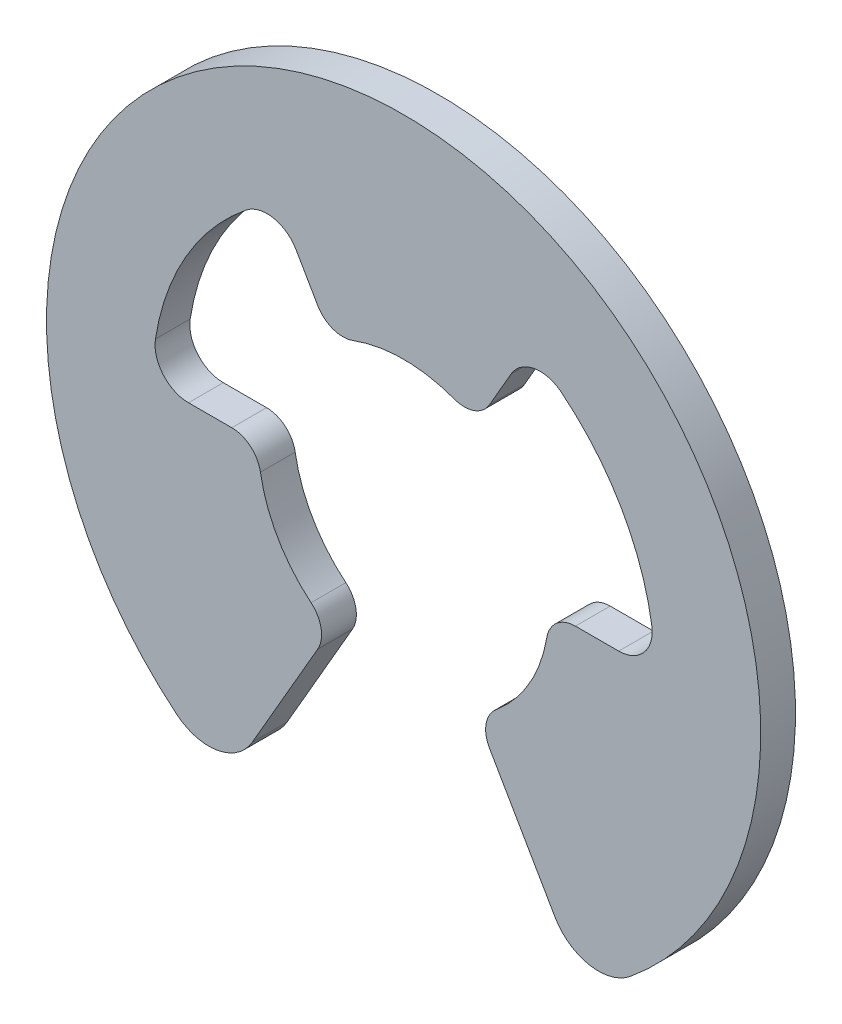
ISO-10303-21;
HEADER;
FILE_DESCRIPTION(('STEP AP214'),'2;1');
FILE_NAME('part.step','',(''),(''),'','','');
FILE_SCHEMA(('AUTOMOTIVE_DESIGN { 1 0 10303 214 1 1 1 1 }'));
ENDSEC;
DATA;
#1=APPLICATION_CONTEXT('core data for automotive mechanical design processes');
#2=APPLICATION_PROTOCOL_DEFINITION('international standard','automotive_design',2000,#1);
#3=PRODUCT_CONTEXT('',#1,'mechanical');
#4=PRODUCT('Part','Part','',(#3));
#5=PRODUCT_RELATED_PRODUCT_CATEGORY('part','',(#4));
#6=PRODUCT_DEFINITION_FORMATION('','',#4);
#7=PRODUCT_DEFINITION_CONTEXT('part definition',#1,'design');
#8=PRODUCT_DEFINITION('design','',#6,#7);
#9=PRODUCT_DEFINITION_SHAPE('','',#8);
#10=(LENGTH_UNIT() NAMED_UNIT(*) SI_UNIT(.MILLI.,.METRE.));
#11=(NAMED_UNIT(*) PLANE_ANGLE_UNIT() SI_UNIT($,.RADIAN.));
#12=(NAMED_UNIT(*) SI_UNIT($,.STERADIAN.) SOLID_ANGLE_UNIT());
#13=UNCERTAINTY_MEASURE_WITH_UNIT(LENGTH_MEASURE(1.E-05),#10,'distance_accuracy_value','');
#14=(GEOMETRIC_REPRESENTATION_CONTEXT(3) GLOBAL_UNCERTAINTY_ASSIGNED_CONTEXT((#13)) GLOBAL_UNIT_ASSIGNED_CONTEXT((#10,
#11,#12)) REPRESENTATION_CONTEXT('',''));
#15=CARTESIAN_POINT('',(0.,0.,0.));
#16=DIRECTION('',(0.,0.,1.));
#17=DIRECTION('',(1.,0.,0.));
#18=AXIS2_PLACEMENT_3D('',#15,#16,#17);
#19=CARTESIAN_POINT('',(5.19771588444957,-6.32300799517449,-0.46355));
#20=DIRECTION('',(0.,0.,1.));
#21=DIRECTION('',(1.,0.,0.));
#22=AXIS2_PLACEMENT_3D('',#19,#20,#21);
#23=PLANE('',#22);
#24=DIRECTION('',(-0.5,0.866025403784439,0.));
#25=VECTOR('',#24,1.);
#26=CARTESIAN_POINT('',(2.29159350398364,-3.96915637919445,-0.46355));
#27=LINE('',#26,#25);
#28=CARTESIAN_POINT('',(4.037371747189,-6.99293299517449,-0.46355));
#29=VERTEX_POINT('',#28);
#30=CARTESIAN_POINT('',(2.29159350398364,-3.96915637919446,-0.46355));
#31=VERTEX_POINT('',#30);
#32=EDGE_CURVE('E178',#29,#31,#27,.T.);
#33=ORIENTED_EDGE('',*,*,#32,.T.);
#34=CARTESIAN_POINT('',(2.96250338429545,-3.58180637919445,-0.46355));
#35=DIRECTION('',(0.,0.,1.));
#36=DIRECTION('',(1.,0.,0.));
#37=AXIS2_PLACEMENT_3D('',#34,#35,#36);
#38=CIRCLE('',#37,0.7747);
#39=CARTESIAN_POINT('',(2.46875282024621,-2.98483864932872,-0.46355));
#40=VERTEX_POINT('',#39);
#41=EDGE_CURVE('E277',#40,#31,#38,.T.);
#42=ORIENTED_EDGE('',*,*,#41,.F.);
#43=CARTESIAN_POINT('',(0.,0.,-0.46355));
#44=DIRECTION('',(0.,0.,1.));
#45=DIRECTION('',(1.,0.,0.));
#46=AXIS2_PLACEMENT_3D('',#43,#44,#45);
#47=CIRCLE('',#46,3.8735);
#48=CARTESIAN_POINT('',(3.81932250466809,-0.6455833449957,-0.46355));
#49=VERTEX_POINT('',#48);
#50=EDGE_CURVE('E280',#40,#49,#47,.T.);
#51=ORIENTED_EDGE('',*,*,#50,.T.);
#52=CARTESIAN_POINT('',(4.58318700796726,-0.774700000000002,-0.46355));
#53=DIRECTION('',(0.,0.,1.));
#54=DIRECTION('',(1.,0.,0.));
#55=AXIS2_PLACEMENT_3D('',#52,#53,#54);
#56=CIRCLE('',#55,0.774700000000002);
#57=CARTESIAN_POINT('',(4.58318700796726,0.,-0.46355));
#58=VERTEX_POINT('',#57);
#59=EDGE_CURVE('E201',#58,#49,#56,.T.);
#60=ORIENTED_EDGE('',*,*,#59,.F.);
#61=DIRECTION('',(1.,0.,0.));
#62=VECTOR('',#61,1.);
#63=CARTESIAN_POINT('',(5.73689495684149,0.,-0.46355));
#64=LINE('',#63,#62);
#65=CARTESIAN_POINT('',(5.73689495684149,0.,-0.46355));
#66=VERTEX_POINT('',#65);
#67=EDGE_CURVE('E198',#58,#66,#64,.T.);
#68=ORIENTED_EDGE('',*,*,#67,.T.);
#69=CARTESIAN_POINT('',(5.73689495684149,0.893233333333334,-0.46355));
#70=DIRECTION('',(0.,0.,1.));
#71=DIRECTION('',(1.,0.,0.));
#72=AXIS2_PLACEMENT_3D('',#69,#70,#71);
#73=CIRCLE('',#72,0.893233333333334);
#74=CARTESIAN_POINT('',(6.61949418097096,1.03065384615385,-0.46355));
#75=VERTEX_POINT('',#74);
#76=EDGE_CURVE('E286',#66,#75,#73,.T.);
#77=ORIENTED_EDGE('',*,*,#76,.T.);
#78=CARTESIAN_POINT('',(0.,0.,-0.46355));
#79=DIRECTION('',(0.,0.,1.));
#80=DIRECTION('',(1.,0.,0.));
#81=AXIS2_PLACEMENT_3D('',#78,#79,#80);
#82=CIRCLE('',#81,6.69925);
#83=CARTESIAN_POINT('',(4.20231950376285,5.21732319784719,-0.46355));
#84=VERTEX_POINT('',#83);
#85=EDGE_CURVE('E290',#75,#84,#82,.T.);
#86=ORIENTED_EDGE('',*,*,#85,.T.);
#87=CARTESIAN_POINT('',(3.64201023659447,4.5216801048009,-0.46355));
#88=DIRECTION('',(0.,0.,1.));
#89=DIRECTION('',(1.,0.,0.));
#90=AXIS2_PLACEMENT_3D('',#87,#88,#89);
#91=CIRCLE('',#90,0.893233333333332);
#92=CARTESIAN_POINT('',(2.86844747842075,4.96829677146756,-0.46355));
#93=VERTEX_POINT('',#92);
#94=EDGE_CURVE('E294',#84,#93,#91,.T.);
#95=ORIENTED_EDGE('',*,*,#94,.T.);
#96=DIRECTION('',(-0.5,-0.866025403784439,0.));
#97=VECTOR('',#96,1.);
#98=CARTESIAN_POINT('',(2.29159350398364,3.96915637919445,-0.46355));
#99=LINE('',#98,#97);
#100=CARTESIAN_POINT('',(2.29159350398364,3.96915637919445,-0.46355));
#101=VERTEX_POINT('',#100);
#102=EDGE_CURVE('E203',#93,#101,#99,.T.);
#103=ORIENTED_EDGE('',*,*,#102,.T.);
#104=CARTESIAN_POINT('',(1.62068362367183,4.35650637919445,-0.46355));
#105=DIRECTION('',(0.,0.,1.));
#106=DIRECTION('',(1.,0.,0.));
#107=AXIS2_PLACEMENT_3D('',#104,#105,#106);
#108=CIRCLE('',#107,0.774699999999997);
#109=CARTESIAN_POINT('',(1.3505696863932,3.63042198266205,-0.46355));
#110=VERTEX_POINT('',#109);
#111=EDGE_CURVE('E297',#110,#101,#108,.T.);
#112=ORIENTED_EDGE('',*,*,#111,.F.);
#113=CARTESIAN_POINT('',(0.,0.,-0.46355));
#114=DIRECTION('',(0.,0.,1.));
#115=DIRECTION('',(1.,0.,0.));
#116=AXIS2_PLACEMENT_3D('',#113,#114,#115);
#117=CIRCLE('',#116,3.8735);
#118=CARTESIAN_POINT('',(-1.35056966565402,3.63042199037731,-0.46355));
#119=VERTEX_POINT('',#118);
#120=EDGE_CURVE('E300',#110,#119,#117,.T.);
#121=ORIENTED_EDGE('',*,*,#120,.T.);
#122=CARTESIAN_POINT('',(-1.62068362367183,4.35650637919445,-0.46355));
#123=DIRECTION('',(0.,0.,1.));
#124=DIRECTION('',(1.,0.,0.));
#125=AXIS2_PLACEMENT_3D('',#122,#123,#124);
#126=CIRCLE('',#125,0.7747);
#127=CARTESIAN_POINT('',(-2.29159350398364,3.96915637919445,-0.46355));
#128=VERTEX_POINT('',#127);
#129=EDGE_CURVE('E211',#128,#119,#126,.T.);
#130=ORIENTED_EDGE('',*,*,#129,.F.);
#131=DIRECTION('',(-0.5,0.866025403784439,0.));
#132=VECTOR('',#131,1.);
#133=CARTESIAN_POINT('',(-2.86844747842075,4.96829677146756,-0.46355));
#134=LINE('',#133,#132);
#135=CARTESIAN_POINT('',(-2.86844747842075,4.96829677146756,-0.46355));
#136=VERTEX_POINT('',#135);
#137=EDGE_CURVE('E208',#128,#136,#134,.T.);
#138=ORIENTED_EDGE('',*,*,#137,.T.);
#139=CARTESIAN_POINT('',(-3.64201023659447,4.5216801048009,-0.46355));
#140=DIRECTION('',(0.,0.,1.));
#141=DIRECTION('',(1.,0.,0.));
#142=AXIS2_PLACEMENT_3D('',#139,#140,#141);
#143=CIRCLE('',#142,0.893233333333332);
#144=CARTESIAN_POINT('',(-4.20231950376285,5.21732319784718,-0.46355));
#145=VERTEX_POINT('',#144);
#146=EDGE_CURVE('E306',#136,#145,#143,.T.);
#147=ORIENTED_EDGE('',*,*,#146,.T.);
#148=CARTESIAN_POINT('',(0.,0.,-0.46355));
#149=DIRECTION('',(0.,0.,1.));
#150=DIRECTION('',(1.,0.,0.));
#151=AXIS2_PLACEMENT_3D('',#148,#149,#150);
#152=CIRCLE('',#151,6.69925);
#153=CARTESIAN_POINT('',(-6.61949418097095,1.03065384615384,-0.46355));
#154=VERTEX_POINT('',#153);
#155=EDGE_CURVE('E310',#145,#154,#152,.T.);
#156=ORIENTED_EDGE('',*,*,#155,.T.);
#157=CARTESIAN_POINT('',(-5.73689495684149,0.893233333333332,-0.46355));
#158=DIRECTION('',(0.,0.,1.));
#159=DIRECTION('',(1.,0.,0.));
#160=AXIS2_PLACEMENT_3D('',#157,#158,#159);
#161=CIRCLE('',#160,0.893233333333332);
#162=CARTESIAN_POINT('',(-5.73689495684149,0.,-0.46355));
#163=VERTEX_POINT('',#162);
#164=EDGE_CURVE('E314',#154,#163,#161,.T.);
#165=ORIENTED_EDGE('',*,*,#164,.T.);
#166=DIRECTION('',(1.,0.,0.));
#167=VECTOR('',#166,1.);
#168=CARTESIAN_POINT('',(-4.58318700796726,0.,-0.46355));
#169=LINE('',#168,#167);
#170=CARTESIAN_POINT('',(-4.58318700796726,0.,-0.46355));
#171=VERTEX_POINT('',#170);
#172=EDGE_CURVE('E213',#163,#171,#169,.T.);
#173=ORIENTED_EDGE('',*,*,#172,.T.);
#174=CARTESIAN_POINT('',(-4.58318700796726,-0.7747,-0.46355));
#175=DIRECTION('',(0.,0.,1.));
#176=DIRECTION('',(1.,0.,0.));
#177=AXIS2_PLACEMENT_3D('',#174,#175,#176);
#178=CIRCLE('',#177,0.7747);
#179=CARTESIAN_POINT('',(-3.81932250663939,-0.645583333333331,-0.46355));
#180=VERTEX_POINT('',#179);
#181=EDGE_CURVE('E317',#180,#171,#178,.T.);
#182=ORIENTED_EDGE('',*,*,#181,.F.);
#183=CARTESIAN_POINT('',(0.,0.,-0.46355));
#184=DIRECTION('',(0.,0.,1.));
#185=DIRECTION('',(1.,0.,0.));
#186=AXIS2_PLACEMENT_3D('',#183,#184,#185);
#187=CIRCLE('',#186,3.8735);
#188=CARTESIAN_POINT('',(-2.46875282024621,-2.98483864932872,-0.46355));
#189=VERTEX_POINT('',#188);
#190=EDGE_CURVE('E320',#180,#189,#187,.T.);
#191=ORIENTED_EDGE('',*,*,#190,.T.);
#192=CARTESIAN_POINT('',(-2.96250338429545,-3.58180637919445,-0.46355));
#193=DIRECTION('',(0.,0.,1.));
#194=DIRECTION('',(1.,0.,0.));
#195=AXIS2_PLACEMENT_3D('',#192,#193,#194);
#196=CIRCLE('',#195,0.7747);
#197=CARTESIAN_POINT('',(-2.29159350398364,-3.96915637919446,-0.46355));
#198=VERTEX_POINT('',#197);
#199=EDGE_CURVE('E221',#198,#189,#196,.T.);
#200=ORIENTED_EDGE('',*,*,#199,.F.);
#201=DIRECTION('',(-0.5,-0.866025403784439,0.));
#202=VECTOR('',#201,1.);
#203=CARTESIAN_POINT('',(-4.037371747189,-6.99293299517449,-0.46355));
#204=LINE('',#203,#202);
#205=CARTESIAN_POINT('',(-4.037371747189,-6.9929329951745,-0.46355));
#206=VERTEX_POINT('',#205);
#207=EDGE_CURVE('E218',#198,#206,#204,.T.);
#208=ORIENTED_EDGE('',*,*,#207,.T.);
#209=CARTESIAN_POINT('',(-5.1977158844496,-6.32300799517449,-0.46355));
#210=DIRECTION('',(0.,0.,1.));
#211=DIRECTION('',(1.,0.,0.));
#212=AXIS2_PLACEMENT_3D('',#209,#210,#211);
#213=CIRCLE('',#212,1.33985);
#214=CARTESIAN_POINT('',(-6.04854447375826,-7.35803878414409,-0.46355));
#215=VERTEX_POINT('',#214);
#216=EDGE_CURVE('E326',#215,#206,#213,.T.);
#217=ORIENTED_EDGE('',*,*,#216,.F.);
#218=CARTESIAN_POINT('',(0.,0.,-0.46355));
#219=DIRECTION('',(0.,0.,1.));
#220=DIRECTION('',(1.,0.,0.));
#221=AXIS2_PLACEMENT_3D('',#218,#219,#220);
#222=CIRCLE('',#221,9.525);
#223=CARTESIAN_POINT('',(6.04854443090217,-7.35803881937316,-0.46355));
#224=VERTEX_POINT('',#223);
#225=EDGE_CURVE('E180',#224,#215,#222,.T.);
#226=ORIENTED_EDGE('',*,*,#225,.F.);
#227=CARTESIAN_POINT('',(5.19771588444957,-6.32300799517449,-0.46355));
#228=DIRECTION('',(0.,0.,1.));
#229=DIRECTION('',(1.,0.,0.));
#230=AXIS2_PLACEMENT_3D('',#227,#228,#229);
#231=CIRCLE('',#230,1.33985);
#232=EDGE_CURVE('E20',#29,#224,#231,.T.);
#233=ORIENTED_EDGE('',*,*,#232,.F.);
#234=EDGE_LOOP('',(#33,#42,#51,#60,#68,#77,#86,#95,#103,#112,#121,#130,#138,#147,#156,#165,#173,
#182,#191,#200,#208,#217,#226,#233));
#235=FACE_BOUND('',#234,.T.);
#236=ADVANCED_FACE('F17',(#235),#23,.F.);
#237=CARTESIAN_POINT('',(5.19771588444957,-6.32300799517449,0.46355));
#238=DIRECTION('',(0.,0.,1.));
#239=DIRECTION('',(1.,0.,0.));
#240=AXIS2_PLACEMENT_3D('',#237,#238,#239);
#241=CYLINDRICAL_SURFACE('',#240,1.33985);
#242=CARTESIAN_POINT('',(5.19771588444957,-6.32300799517449,0.46355));
#243=DIRECTION('',(0.,0.,1.));
#244=DIRECTION('',(1.,0.,0.));
#245=AXIS2_PLACEMENT_3D('',#242,#243,#244);
#246=CIRCLE('',#245,1.33985);
#247=CARTESIAN_POINT('',(4.037371747189,-6.99293299517449,0.46355));
#248=VERTEX_POINT('',#247);
#249=CARTESIAN_POINT('',(6.04854443090217,-7.35803881937316,0.46355));
#250=VERTEX_POINT('',#249);
#251=EDGE_CURVE('E187',#248,#250,#246,.T.);
#252=ORIENTED_EDGE('',*,*,#251,.F.);
#253=DIRECTION('',(0.,0.,1.));
#254=VECTOR('',#253,1.);
#255=CARTESIAN_POINT('',(4.037371747189,-6.99293299517449,0.46355));
#256=LINE('',#255,#254);
#257=EDGE_CURVE('E184',#248,#29,#256,.F.);
#258=ORIENTED_EDGE('',*,*,#257,.T.);
#259=ORIENTED_EDGE('',*,*,#232,.T.);
#260=DIRECTION('',(0.,0.,1.));
#261=VECTOR('',#260,1.);
#262=CARTESIAN_POINT('',(6.04854438804611,-7.35803885460222,0.46355));
#263=LINE('',#262,#261);
#264=EDGE_CURVE('E196',#250,#224,#263,.F.);
#265=ORIENTED_EDGE('',*,*,#264,.F.);
#266=EDGE_LOOP('',(#252,#258,#259,#265));
#267=FACE_BOUND('',#266,.T.);
#268=ADVANCED_FACE('F185',(#267),#241,.T.);
#269=CARTESIAN_POINT('',(0.,0.,0.46355));
#270=DIRECTION('',(0.,0.,1.));
#271=DIRECTION('',(1.,0.,0.));
#272=AXIS2_PLACEMENT_3D('',#269,#270,#271);
#273=CYLINDRICAL_SURFACE('',#272,9.525);
#274=CARTESIAN_POINT('',(0.,0.,0.46355));
#275=DIRECTION('',(0.,0.,1.));
#276=DIRECTION('',(1.,0.,0.));
#277=AXIS2_PLACEMENT_3D('',#274,#275,#276);
#278=CIRCLE('',#277,9.525);
#279=CARTESIAN_POINT('',(-6.04854447375826,-7.35803878414409,0.46355));
#280=VERTEX_POINT('',#279);
#281=EDGE_CURVE('E192',#250,#280,#278,.T.);
#282=ORIENTED_EDGE('',*,*,#281,.F.);
#283=ORIENTED_EDGE('',*,*,#264,.T.);
#284=ORIENTED_EDGE('',*,*,#225,.T.);
#285=DIRECTION('',(0.,0.,1.));
#286=VECTOR('',#285,1.);
#287=CARTESIAN_POINT('',(-6.04854447375826,-7.35803878414409,0.46355));
#288=LINE('',#287,#286);
#289=EDGE_CURVE('E327',#280,#215,#288,.F.);
#290=ORIENTED_EDGE('',*,*,#289,.F.);
#291=EDGE_LOOP('',(#282,#283,#284,#290));
#292=FACE_BOUND('',#291,.T.);
#293=ADVANCED_FACE('F331',(#292),#273,.T.);
#294=CARTESIAN_POINT('',(-5.1977158844496,-6.32300799517449,0.46355));
#295=DIRECTION('',(0.,0.,1.));
#296=DIRECTION('',(1.,0.,0.));
#297=AXIS2_PLACEMENT_3D('',#294,#295,#296);
#298=CYLINDRICAL_SURFACE('',#297,1.33985);
#299=CARTESIAN_POINT('',(-5.1977158844496,-6.32300799517449,0.46355));
#300=DIRECTION('',(0.,0.,1.));
#301=DIRECTION('',(1.,0.,0.));
#302=AXIS2_PLACEMENT_3D('',#299,#300,#301);
#303=CIRCLE('',#302,1.33985);
#304=CARTESIAN_POINT('',(-4.037371747189,-6.99293299517449,0.46355));
#305=VERTEX_POINT('',#304);
#306=EDGE_CURVE('E272',#280,#305,#303,.T.);
#307=ORIENTED_EDGE('',*,*,#306,.F.);
#308=ORIENTED_EDGE('',*,*,#289,.T.);
#309=ORIENTED_EDGE('',*,*,#216,.T.);
#310=DIRECTION('',(0.,0.,1.));
#311=VECTOR('',#310,1.);
#312=CARTESIAN_POINT('',(-4.037371747189,-6.99293299517449,0.46355));
#313=LINE('',#312,#311);
#314=EDGE_CURVE('E222',#206,#305,#313,.T.);
#315=ORIENTED_EDGE('',*,*,#314,.T.);
#316=EDGE_LOOP('',(#307,#308,#309,#315));
#317=FACE_BOUND('',#316,.T.);
#318=ADVANCED_FACE('F367',(#317),#298,.T.);
#319=CARTESIAN_POINT('',(-4.037371747189,-6.99293299517449,0.46355));
#320=DIRECTION('',(-0.866025403784439,0.5,0.));
#321=DIRECTION('',(-0.5,-0.866025403784439,0.));
#322=AXIS2_PLACEMENT_3D('',#319,#320,#321);
#323=PLANE('',#322);
#324=DIRECTION('',(0.,0.,1.));
#325=VECTOR('',#324,1.);
#326=CARTESIAN_POINT('',(-2.29159350398365,-3.96915637919445,0.46355));
#327=LINE('',#326,#325);
#328=CARTESIAN_POINT('',(-2.29159350398364,-3.96915637919445,0.46355));
#329=VERTEX_POINT('',#328);
#330=EDGE_CURVE('E325',#329,#198,#327,.F.);
#331=ORIENTED_EDGE('',*,*,#330,.F.);
#332=DIRECTION('',(0.499999999999998,0.86602540378444,0.));
#333=VECTOR('',#332,1.);
#334=CARTESIAN_POINT('',(-4.037371747189,-6.99293299517449,0.46355));
#335=LINE('',#334,#333);
#336=EDGE_CURVE('E271',#305,#329,#335,.T.);
#337=ORIENTED_EDGE('',*,*,#336,.F.);
#338=ORIENTED_EDGE('',*,*,#314,.F.);
#339=ORIENTED_EDGE('',*,*,#207,.F.);
#340=EDGE_LOOP('',(#331,#337,#338,#339));
#341=FACE_BOUND('',#340,.T.);
#342=ADVANCED_FACE('F587',(#341),#323,.F.);
#343=CARTESIAN_POINT('',(-2.96250338429545,-3.58180637919445,0.46355));
#344=DIRECTION('',(0.,0.,1.));
#345=DIRECTION('',(1.,0.,0.));
#346=AXIS2_PLACEMENT_3D('',#343,#344,#345);
#347=CYLINDRICAL_SURFACE('',#346,0.7747);
#348=CARTESIAN_POINT('',(-2.96250338429545,-3.58180637919445,0.46355));
#349=DIRECTION('',(0.,0.,1.));
#350=DIRECTION('',(1.,0.,0.));
#351=AXIS2_PLACEMENT_3D('',#348,#349,#350);
#352=CIRCLE('',#351,0.7747);
#353=CARTESIAN_POINT('',(-2.46875282024621,-2.98483864932872,0.46355));
#354=VERTEX_POINT('',#353);
#355=EDGE_CURVE('E268',#329,#354,#352,.T.);
#356=ORIENTED_EDGE('',*,*,#355,.F.);
#357=ORIENTED_EDGE('',*,*,#330,.T.);
#358=ORIENTED_EDGE('',*,*,#199,.T.);
#359=DIRECTION('',(0.,0.,1.));
#360=VECTOR('',#359,1.);
#361=CARTESIAN_POINT('',(-2.4687528202462,-2.98483864932872,0.46355));
#362=LINE('',#361,#360);
#363=EDGE_CURVE('E323',#189,#354,#362,.T.);
#364=ORIENTED_EDGE('',*,*,#363,.T.);
#365=EDGE_LOOP('',(#356,#357,#358,#364));
#366=FACE_BOUND('',#365,.T.);
#367=ADVANCED_FACE('F577',(#366),#347,.T.);
#368=CARTESIAN_POINT('',(0.,0.,0.46355));
#369=DIRECTION('',(0.,0.,1.));
#370=DIRECTION('',(1.,0.,0.));
#371=AXIS2_PLACEMENT_3D('',#368,#369,#370);
#372=CYLINDRICAL_SURFACE('',#371,3.8735);
#373=DIRECTION('',(0.,0.,1.));
#374=VECTOR('',#373,1.);
#375=CARTESIAN_POINT('',(-3.81932250663939,-0.645583333333329,0.46355));
#376=LINE('',#375,#374);
#377=CARTESIAN_POINT('',(-3.81932250663939,-0.645583333333331,0.46355));
#378=VERTEX_POINT('',#377);
#379=EDGE_CURVE('E319',#378,#180,#376,.F.);
#380=ORIENTED_EDGE('',*,*,#379,.F.);
#381=CARTESIAN_POINT('',(0.,0.,0.46355));
#382=DIRECTION('',(0.,0.,1.));
#383=DIRECTION('',(1.,0.,0.));
#384=AXIS2_PLACEMENT_3D('',#381,#382,#383);
#385=CIRCLE('',#384,3.8735);
#386=EDGE_CURVE('E265',#354,#378,#385,.F.);
#387=ORIENTED_EDGE('',*,*,#386,.F.);
#388=ORIENTED_EDGE('',*,*,#363,.F.);
#389=ORIENTED_EDGE('',*,*,#190,.F.);
#390=EDGE_LOOP('',(#380,#387,#388,#389));
#391=FACE_BOUND('',#390,.T.);
#392=ADVANCED_FACE('F567',(#391),#372,.F.);
#393=CARTESIAN_POINT('',(-4.58318700796726,-0.7747,0.46355));
#394=DIRECTION('',(0.,0.,1.));
#395=DIRECTION('',(1.,0.,0.));
#396=AXIS2_PLACEMENT_3D('',#393,#394,#395);
#397=CYLINDRICAL_SURFACE('',#396,0.7747);
#398=CARTESIAN_POINT('',(-4.58318700796726,-0.7747,0.46355));
#399=DIRECTION('',(0.,0.,1.));
#400=DIRECTION('',(1.,0.,0.));
#401=AXIS2_PLACEMENT_3D('',#398,#399,#400);
#402=CIRCLE('',#401,0.7747);
#403=CARTESIAN_POINT('',(-4.58318700796726,0.,0.46355));
#404=VERTEX_POINT('',#403);
#405=EDGE_CURVE('E262',#378,#404,#402,.T.);
#406=ORIENTED_EDGE('',*,*,#405,.F.);
#407=ORIENTED_EDGE('',*,*,#379,.T.);
#408=ORIENTED_EDGE('',*,*,#181,.T.);
#409=DIRECTION('',(0.,0.,-1.));
#410=VECTOR('',#409,1.);
#411=CARTESIAN_POINT('',(-4.58318700796726,0.,0.46355));
#412=LINE('',#411,#410);
#413=EDGE_CURVE('E217',#171,#404,#412,.F.);
#414=ORIENTED_EDGE('',*,*,#413,.T.);
#415=EDGE_LOOP('',(#406,#407,#408,#414));
#416=FACE_BOUND('',#415,.T.);
#417=ADVANCED_FACE('F557',(#416),#397,.T.);
#418=CARTESIAN_POINT('',(-4.58318700796726,0.,0.46355));
#419=DIRECTION('',(0.,-1.,0.));
#420=DIRECTION('',(0.,0.,-1.));
#421=AXIS2_PLACEMENT_3D('',#418,#419,#420);
#422=PLANE('',#421);
#423=DIRECTION('',(0.,0.,1.));
#424=VECTOR('',#423,1.);
#425=CARTESIAN_POINT('',(-5.73689495684149,0.,0.46355));
#426=LINE('',#425,#424);
#427=CARTESIAN_POINT('',(-5.73689495684149,0.,0.46355));
#428=VERTEX_POINT('',#427);
#429=EDGE_CURVE('E216',#163,#428,#426,.T.);
#430=ORIENTED_EDGE('',*,*,#429,.T.);
#431=DIRECTION('',(1.,0.,0.));
#432=VECTOR('',#431,1.);
#433=CARTESIAN_POINT('',(5.19771588444957,0.,0.46355));
#434=LINE('',#433,#432);
#435=EDGE_CURVE('E261',#404,#428,#434,.F.);
#436=ORIENTED_EDGE('',*,*,#435,.F.);
#437=ORIENTED_EDGE('',*,*,#413,.F.);
#438=ORIENTED_EDGE('',*,*,#172,.F.);
#439=EDGE_LOOP('',(#430,#436,#437,#438));
#440=FACE_BOUND('',#439,.T.);
#441=ADVANCED_FACE('F547',(#440),#422,.F.);
#442=CARTESIAN_POINT('',(-5.73689495684149,0.893233333333332,0.46355));
#443=DIRECTION('',(0.,0.,1.));
#444=DIRECTION('',(1.,0.,0.));
#445=AXIS2_PLACEMENT_3D('',#442,#443,#444);
#446=CYLINDRICAL_SURFACE('',#445,0.893233333333332);
#447=DIRECTION('',(0.,0.,1.));
#448=VECTOR('',#447,1.);
#449=CARTESIAN_POINT('',(-6.61949418097094,1.03065384615384,0.46355));
#450=LINE('',#449,#448);
#451=CARTESIAN_POINT('',(-6.61949418097094,1.03065384615384,0.46355));
#452=VERTEX_POINT('',#451);
#453=EDGE_CURVE('E313',#154,#452,#450,.T.);
#454=ORIENTED_EDGE('',*,*,#453,.T.);
#455=CARTESIAN_POINT('',(-5.73689495684149,0.893233333333332,0.46355));
#456=DIRECTION('',(0.,0.,1.));
#457=DIRECTION('',(1.,0.,0.));
#458=AXIS2_PLACEMENT_3D('',#455,#456,#457);
#459=CIRCLE('',#458,0.893233333333332);
#460=EDGE_CURVE('E258',#428,#452,#459,.F.);
#461=ORIENTED_EDGE('',*,*,#460,.F.);
#462=ORIENTED_EDGE('',*,*,#429,.F.);
#463=ORIENTED_EDGE('',*,*,#164,.F.);
#464=EDGE_LOOP('',(#454,#461,#462,#463));
#465=FACE_BOUND('',#464,.T.);
#466=ADVANCED_FACE('F537',(#465),#446,.F.);
#467=CARTESIAN_POINT('',(0.,0.,0.46355));
#468=DIRECTION('',(0.,0.,1.));
#469=DIRECTION('',(1.,0.,0.));
#470=AXIS2_PLACEMENT_3D('',#467,#468,#469);
#471=CYLINDRICAL_SURFACE('',#470,6.69925);
#472=DIRECTION('',(0.,0.,1.));
#473=VECTOR('',#472,1.);
#474=CARTESIAN_POINT('',(-4.20231950376285,5.21732319784719,0.46355));
#475=LINE('',#474,#473);
#476=CARTESIAN_POINT('',(-4.20231950376285,5.21732319784719,0.46355));
#477=VERTEX_POINT('',#476);
#478=EDGE_CURVE('E309',#145,#477,#475,.T.);
#479=ORIENTED_EDGE('',*,*,#478,.T.);
#480=CARTESIAN_POINT('',(0.,0.,0.46355));
#481=DIRECTION('',(0.,0.,1.));
#482=DIRECTION('',(1.,0.,0.));
#483=AXIS2_PLACEMENT_3D('',#480,#481,#482);
#484=CIRCLE('',#483,6.69925);
#485=EDGE_CURVE('E255',#452,#477,#484,.F.);
#486=ORIENTED_EDGE('',*,*,#485,.F.);
#487=ORIENTED_EDGE('',*,*,#453,.F.);
#488=ORIENTED_EDGE('',*,*,#155,.F.);
#489=EDGE_LOOP('',(#479,#486,#487,#488));
#490=FACE_BOUND('',#489,.T.);
#491=ADVANCED_FACE('F527',(#490),#471,.F.);
#492=CARTESIAN_POINT('',(-3.64201023659447,4.5216801048009,0.46355));
#493=DIRECTION('',(0.,0.,1.));
#494=DIRECTION('',(1.,0.,0.));
#495=AXIS2_PLACEMENT_3D('',#492,#493,#494);
#496=CYLINDRICAL_SURFACE('',#495,0.893233333333332);
#497=DIRECTION('',(0.,0.,1.));
#498=VECTOR('',#497,1.);
#499=CARTESIAN_POINT('',(-2.86844747842075,4.96829677146756,0.46355));
#500=LINE('',#499,#498);
#501=CARTESIAN_POINT('',(-2.86844747842075,4.96829677146757,0.46355));
#502=VERTEX_POINT('',#501);
#503=EDGE_CURVE('E212',#136,#502,#500,.T.);
#504=ORIENTED_EDGE('',*,*,#503,.T.);
#505=CARTESIAN_POINT('',(-3.64201023659447,4.5216801048009,0.46355));
#506=DIRECTION('',(0.,0.,1.));
#507=DIRECTION('',(1.,0.,0.));
#508=AXIS2_PLACEMENT_3D('',#505,#506,#507);
#509=CIRCLE('',#508,0.893233333333332);
#510=EDGE_CURVE('E252',#477,#502,#509,.F.);
#511=ORIENTED_EDGE('',*,*,#510,.F.);
#512=ORIENTED_EDGE('',*,*,#478,.F.);
#513=ORIENTED_EDGE('',*,*,#146,.F.);
#514=EDGE_LOOP('',(#504,#511,#512,#513));
#515=FACE_BOUND('',#514,.T.);
#516=ADVANCED_FACE('F517',(#515),#496,.F.);
#517=CARTESIAN_POINT('',(-2.86844747842075,4.96829677146756,0.46355));
#518=DIRECTION('',(0.866025403784439,0.5,0.));
#519=DIRECTION('',(-0.5,0.866025403784439,0.));
#520=AXIS2_PLACEMENT_3D('',#517,#518,#519);
#521=PLANE('',#520);
#522=DIRECTION('',(0.,0.,1.));
#523=VECTOR('',#522,1.);
#524=CARTESIAN_POINT('',(-2.29159350398363,3.96915637919445,0.46355));
#525=LINE('',#524,#523);
#526=CARTESIAN_POINT('',(-2.29159350398363,3.96915637919445,0.46355));
#527=VERTEX_POINT('',#526);
#528=EDGE_CURVE('E305',#527,#128,#525,.F.);
#529=ORIENTED_EDGE('',*,*,#528,.F.);
#530=DIRECTION('',(0.500000000000005,-0.866025403784436,0.));
#531=VECTOR('',#530,1.);
#532=CARTESIAN_POINT('',(-2.86844747842075,4.96829677146756,0.46355));
#533=LINE('',#532,#531);
#534=EDGE_CURVE('E251',#502,#527,#533,.T.);
#535=ORIENTED_EDGE('',*,*,#534,.F.);
#536=ORIENTED_EDGE('',*,*,#503,.F.);
#537=ORIENTED_EDGE('',*,*,#137,.F.);
#538=EDGE_LOOP('',(#529,#535,#536,#537));
#539=FACE_BOUND('',#538,.T.);
#540=ADVANCED_FACE('F507',(#539),#521,.F.);
#541=CARTESIAN_POINT('',(-1.62068362367183,4.35650637919445,0.46355));
#542=DIRECTION('',(0.,0.,1.));
#543=DIRECTION('',(1.,0.,0.));
#544=AXIS2_PLACEMENT_3D('',#541,#542,#543);
#545=CYLINDRICAL_SURFACE('',#544,0.7747);
#546=CARTESIAN_POINT('',(-1.62068362367183,4.35650637919445,0.46355));
#547=DIRECTION('',(0.,0.,1.));
#548=DIRECTION('',(1.,0.,0.));
#549=AXIS2_PLACEMENT_3D('',#546,#547,#548);
#550=CIRCLE('',#549,0.7747);
#551=CARTESIAN_POINT('',(-1.35056966565402,3.63042199037731,0.46355));
#552=VERTEX_POINT('',#551);
#553=EDGE_CURVE('E248',#527,#552,#550,.T.);
#554=ORIENTED_EDGE('',*,*,#553,.F.);
#555=ORIENTED_EDGE('',*,*,#528,.T.);
#556=ORIENTED_EDGE('',*,*,#129,.T.);
#557=DIRECTION('',(0.,0.,1.));
#558=VECTOR('',#557,1.);
#559=CARTESIAN_POINT('',(-1.35056964491485,3.63042199809258,0.46355));
#560=LINE('',#559,#558);
#561=EDGE_CURVE('E303',#119,#552,#560,.T.);
#562=ORIENTED_EDGE('',*,*,#561,.T.);
#563=EDGE_LOOP('',(#554,#555,#556,#562));
#564=FACE_BOUND('',#563,.T.);
#565=ADVANCED_FACE('F497',(#564),#545,.T.);
#566=CARTESIAN_POINT('',(0.,0.,0.46355));
#567=DIRECTION('',(0.,0.,1.));
#568=DIRECTION('',(1.,0.,0.));
#569=AXIS2_PLACEMENT_3D('',#566,#567,#568);
#570=CYLINDRICAL_SURFACE('',#569,3.8735);
#571=DIRECTION('',(0.,0.,1.));
#572=VECTOR('',#571,1.);
#573=CARTESIAN_POINT('',(1.3505696863932,3.63042198266205,0.46355));
#574=LINE('',#573,#572);
#575=CARTESIAN_POINT('',(1.3505696863932,3.63042198266205,0.46355));
#576=VERTEX_POINT('',#575);
#577=EDGE_CURVE('E299',#576,#110,#574,.F.);
#578=ORIENTED_EDGE('',*,*,#577,.F.);
#579=CARTESIAN_POINT('',(0.,0.,0.46355));
#580=DIRECTION('',(0.,0.,1.));
#581=DIRECTION('',(1.,0.,0.));
#582=AXIS2_PLACEMENT_3D('',#579,#580,#581);
#583=CIRCLE('',#582,3.8735);
#584=EDGE_CURVE('E245',#552,#576,#583,.F.);
#585=ORIENTED_EDGE('',*,*,#584,.F.);
#586=ORIENTED_EDGE('',*,*,#561,.F.);
#587=ORIENTED_EDGE('',*,*,#120,.F.);
#588=EDGE_LOOP('',(#578,#585,#586,#587));
#589=FACE_BOUND('',#588,.T.);
#590=ADVANCED_FACE('F487',(#589),#570,.F.);
#591=CARTESIAN_POINT('',(1.62068362367183,4.35650637919445,0.46355));
#592=DIRECTION('',(0.,0.,1.));
#593=DIRECTION('',(1.,0.,0.));
#594=AXIS2_PLACEMENT_3D('',#591,#592,#593);
#595=CYLINDRICAL_SURFACE('',#594,0.774699999999997);
#596=CARTESIAN_POINT('',(1.62068362367183,4.35650637919445,0.46355));
#597=DIRECTION('',(0.,0.,1.));
#598=DIRECTION('',(1.,0.,0.));
#599=AXIS2_PLACEMENT_3D('',#596,#597,#598);
#600=CIRCLE('',#599,0.774699999999997);
#601=CARTESIAN_POINT('',(2.29159350398364,3.96915637919445,0.46355));
#602=VERTEX_POINT('',#601);
#603=EDGE_CURVE('E242',#576,#602,#600,.T.);
#604=ORIENTED_EDGE('',*,*,#603,.F.);
#605=ORIENTED_EDGE('',*,*,#577,.T.);
#606=ORIENTED_EDGE('',*,*,#111,.T.);
#607=DIRECTION('',(0.,0.,1.));
#608=VECTOR('',#607,1.);
#609=CARTESIAN_POINT('',(2.29159350398364,3.96915637919445,0.46355));
#610=LINE('',#609,#608);
#611=EDGE_CURVE('E207',#101,#602,#610,.T.);
#612=ORIENTED_EDGE('',*,*,#611,.T.);
#613=EDGE_LOOP('',(#604,#605,#606,#612));
#614=FACE_BOUND('',#613,.T.);
#615=ADVANCED_FACE('F477',(#614),#595,.T.);
#616=CARTESIAN_POINT('',(2.29159350398364,3.96915637919445,0.46355));
#617=DIRECTION('',(-0.866025403784439,0.5,0.));
#618=DIRECTION('',(-0.5,-0.866025403784439,0.));
#619=AXIS2_PLACEMENT_3D('',#616,#617,#618);
#620=PLANE('',#619);
#621=DIRECTION('',(0.,0.,1.));
#622=VECTOR('',#621,1.);
#623=CARTESIAN_POINT('',(2.86844747842075,4.96829677146756,0.46355));
#624=LINE('',#623,#622);
#625=CARTESIAN_POINT('',(2.86844747842075,4.96829677146756,0.46355));
#626=VERTEX_POINT('',#625);
#627=EDGE_CURVE('E206',#93,#626,#624,.T.);
#628=ORIENTED_EDGE('',*,*,#627,.T.);
#629=DIRECTION('',(0.500000000000003,0.866025403784437,0.));
#630=VECTOR('',#629,1.);
#631=CARTESIAN_POINT('',(2.29159350398364,3.96915637919445,0.46355));
#632=LINE('',#631,#630);
#633=EDGE_CURVE('E241',#602,#626,#632,.T.);
#634=ORIENTED_EDGE('',*,*,#633,.F.);
#635=ORIENTED_EDGE('',*,*,#611,.F.);
#636=ORIENTED_EDGE('',*,*,#102,.F.);
#637=EDGE_LOOP('',(#628,#634,#635,#636));
#638=FACE_BOUND('',#637,.T.);
#639=ADVANCED_FACE('F467',(#638),#620,.F.);
#640=CARTESIAN_POINT('',(3.64201023659447,4.5216801048009,0.46355));
#641=DIRECTION('',(0.,0.,1.));
#642=DIRECTION('',(1.,0.,0.));
#643=AXIS2_PLACEMENT_3D('',#640,#641,#642);
#644=CYLINDRICAL_SURFACE('',#643,0.893233333333332);
#645=DIRECTION('',(0.,0.,1.));
#646=VECTOR('',#645,1.);
#647=CARTESIAN_POINT('',(4.20231950376285,5.21732319784719,0.46355));
#648=LINE('',#647,#646);
#649=CARTESIAN_POINT('',(4.20231950376285,5.21732319784719,0.46355));
#650=VERTEX_POINT('',#649);
#651=EDGE_CURVE('E293',#84,#650,#648,.T.);
#652=ORIENTED_EDGE('',*,*,#651,.T.);
#653=CARTESIAN_POINT('',(3.64201023659447,4.5216801048009,0.46355));
#654=DIRECTION('',(0.,0.,1.));
#655=DIRECTION('',(1.,0.,0.));
#656=AXIS2_PLACEMENT_3D('',#653,#654,#655);
#657=CIRCLE('',#656,0.893233333333332);
#658=EDGE_CURVE('E238',#626,#650,#657,.F.);
#659=ORIENTED_EDGE('',*,*,#658,.F.);
#660=ORIENTED_EDGE('',*,*,#627,.F.);
#661=ORIENTED_EDGE('',*,*,#94,.F.);
#662=EDGE_LOOP('',(#652,#659,#660,#661));
#663=FACE_BOUND('',#662,.T.);
#664=ADVANCED_FACE('F457',(#663),#644,.F.);
#665=CARTESIAN_POINT('',(0.,0.,0.46355));
#666=DIRECTION('',(0.,0.,1.));
#667=DIRECTION('',(1.,0.,0.));
#668=AXIS2_PLACEMENT_3D('',#665,#666,#667);
#669=CYLINDRICAL_SURFACE('',#668,6.69925);
#670=DIRECTION('',(0.,0.,1.));
#671=VECTOR('',#670,1.);
#672=CARTESIAN_POINT('',(6.61949418097096,1.03065384615384,0.46355));
#673=LINE('',#672,#671);
#674=CARTESIAN_POINT('',(6.61949418097096,1.03065384615384,0.46355));
#675=VERTEX_POINT('',#674);
#676=EDGE_CURVE('E289',#75,#675,#673,.T.);
#677=ORIENTED_EDGE('',*,*,#676,.T.);
#678=CARTESIAN_POINT('',(0.,0.,0.46355));
#679=DIRECTION('',(0.,0.,1.));
#680=DIRECTION('',(1.,0.,0.));
#681=AXIS2_PLACEMENT_3D('',#678,#679,#680);
#682=CIRCLE('',#681,6.69925);
#683=EDGE_CURVE('E235',#650,#675,#682,.F.);
#684=ORIENTED_EDGE('',*,*,#683,.F.);
#685=ORIENTED_EDGE('',*,*,#651,.F.);
#686=ORIENTED_EDGE('',*,*,#85,.F.);
#687=EDGE_LOOP('',(#677,#684,#685,#686));
#688=FACE_BOUND('',#687,.T.);
#689=ADVANCED_FACE('F447',(#688),#669,.F.);
#690=CARTESIAN_POINT('',(5.73689495684149,0.893233333333334,0.46355));
#691=DIRECTION('',(0.,0.,1.));
#692=DIRECTION('',(1.,0.,0.));
#693=AXIS2_PLACEMENT_3D('',#690,#691,#692);
#694=CYLINDRICAL_SURFACE('',#693,0.893233333333334);
#695=DIRECTION('',(0.,0.,-1.));
#696=VECTOR('',#695,1.);
#697=CARTESIAN_POINT('',(5.73689495684149,0.,0.46355));
#698=LINE('',#697,#696);
#699=CARTESIAN_POINT('',(5.73689495684149,0.,0.46355));
#700=VERTEX_POINT('',#699);
#701=EDGE_CURVE('E202',#66,#700,#698,.F.);
#702=ORIENTED_EDGE('',*,*,#701,.T.);
#703=CARTESIAN_POINT('',(5.73689495684149,0.893233333333334,0.46355));
#704=DIRECTION('',(0.,0.,1.));
#705=DIRECTION('',(1.,0.,0.));
#706=AXIS2_PLACEMENT_3D('',#703,#704,#705);
#707=CIRCLE('',#706,0.893233333333334);
#708=EDGE_CURVE('E232',#675,#700,#707,.F.);
#709=ORIENTED_EDGE('',*,*,#708,.F.);
#710=ORIENTED_EDGE('',*,*,#676,.F.);
#711=ORIENTED_EDGE('',*,*,#76,.F.);
#712=EDGE_LOOP('',(#702,#709,#710,#711));
#713=FACE_BOUND('',#712,.T.);
#714=ADVANCED_FACE('F438',(#713),#694,.F.);
#715=CARTESIAN_POINT('',(5.73689495684149,0.,0.46355));
#716=DIRECTION('',(0.,-1.,0.));
#717=DIRECTION('',(0.,0.,-1.));
#718=AXIS2_PLACEMENT_3D('',#715,#716,#717);
#719=PLANE('',#718);
#720=DIRECTION('',(0.,0.,1.));
#721=VECTOR('',#720,1.);
#722=CARTESIAN_POINT('',(4.58318700796726,0.,0.46355));
#723=LINE('',#722,#721);
#724=CARTESIAN_POINT('',(4.58318700796726,0.,0.46355));
#725=VERTEX_POINT('',#724);
#726=EDGE_CURVE('E285',#725,#58,#723,.F.);
#727=ORIENTED_EDGE('',*,*,#726,.F.);
#728=DIRECTION('',(1.,0.,0.));
#729=VECTOR('',#728,1.);
#730=CARTESIAN_POINT('',(5.19771588444957,0.,0.46355));
#731=LINE('',#730,#729);
#732=EDGE_CURVE('E231',#700,#725,#731,.F.);
#733=ORIENTED_EDGE('',*,*,#732,.F.);
#734=ORIENTED_EDGE('',*,*,#701,.F.);
#735=ORIENTED_EDGE('',*,*,#67,.F.);
#736=EDGE_LOOP('',(#727,#733,#734,#735));
#737=FACE_BOUND('',#736,.T.);
#738=ADVANCED_FACE('F387',(#737),#719,.F.);
#739=CARTESIAN_POINT('',(4.58318700796726,-0.774700000000002,0.46355));
#740=DIRECTION('',(0.,0.,1.));
#741=DIRECTION('',(1.,0.,0.));
#742=AXIS2_PLACEMENT_3D('',#739,#740,#741);
#743=CYLINDRICAL_SURFACE('',#742,0.774700000000002);
#744=CARTESIAN_POINT('',(4.58318700796726,-0.774700000000002,0.46355));
#745=DIRECTION('',(0.,0.,1.));
#746=DIRECTION('',(1.,0.,0.));
#747=AXIS2_PLACEMENT_3D('',#744,#745,#746);
#748=CIRCLE('',#747,0.774700000000002);
#749=CARTESIAN_POINT('',(3.81932250466809,-0.645583344995701,0.46355));
#750=VERTEX_POINT('',#749);
#751=EDGE_CURVE('E228',#725,#750,#748,.T.);
#752=ORIENTED_EDGE('',*,*,#751,.F.);
#753=ORIENTED_EDGE('',*,*,#726,.T.);
#754=ORIENTED_EDGE('',*,*,#59,.T.);
#755=DIRECTION('',(0.,0.,1.));
#756=VECTOR('',#755,1.);
#757=CARTESIAN_POINT('',(3.81932250269679,-0.645583356658065,0.46355));
#758=LINE('',#757,#756);
#759=EDGE_CURVE('E283',#49,#750,#758,.T.);
#760=ORIENTED_EDGE('',*,*,#759,.T.);
#761=EDGE_LOOP('',(#752,#753,#754,#760));
#762=FACE_BOUND('',#761,.T.);
#763=ADVANCED_FACE('F390',(#762),#743,.T.);
#764=CARTESIAN_POINT('',(0.,0.,0.46355));
#765=DIRECTION('',(0.,0.,1.));
#766=DIRECTION('',(1.,0.,0.));
#767=AXIS2_PLACEMENT_3D('',#764,#765,#766);
#768=CYLINDRICAL_SURFACE('',#767,3.8735);
#769=DIRECTION('',(0.,0.,1.));
#770=VECTOR('',#769,1.);
#771=CARTESIAN_POINT('',(2.4687528202462,-2.98483864932872,0.46355));
#772=LINE('',#771,#770);
#773=CARTESIAN_POINT('',(2.46875282024621,-2.98483864932872,0.46355));
#774=VERTEX_POINT('',#773);
#775=EDGE_CURVE('E279',#774,#40,#772,.F.);
#776=ORIENTED_EDGE('',*,*,#775,.F.);
#777=CARTESIAN_POINT('',(0.,0.,0.46355));
#778=DIRECTION('',(0.,0.,1.));
#779=DIRECTION('',(1.,0.,0.));
#780=AXIS2_PLACEMENT_3D('',#777,#778,#779);
#781=CIRCLE('',#780,3.8735);
#782=EDGE_CURVE('E225',#750,#774,#781,.F.);
#783=ORIENTED_EDGE('',*,*,#782,.F.);
#784=ORIENTED_EDGE('',*,*,#759,.F.);
#785=ORIENTED_EDGE('',*,*,#50,.F.);
#786=EDGE_LOOP('',(#776,#783,#784,#785));
#787=FACE_BOUND('',#786,.T.);
#788=ADVANCED_FACE('F392',(#787),#768,.F.);
#789=CARTESIAN_POINT('',(2.96250338429545,-3.58180637919445,0.46355));
#790=DIRECTION('',(0.,0.,1.));
#791=DIRECTION('',(1.,0.,0.));
#792=AXIS2_PLACEMENT_3D('',#789,#790,#791);
#793=CYLINDRICAL_SURFACE('',#792,0.7747);
#794=CARTESIAN_POINT('',(2.96250338429545,-3.58180637919445,0.46355));
#795=DIRECTION('',(0.,0.,1.));
#796=DIRECTION('',(1.,0.,0.));
#797=AXIS2_PLACEMENT_3D('',#794,#795,#796);
#798=CIRCLE('',#797,0.7747);
#799=CARTESIAN_POINT('',(2.29159350398364,-3.96915637919446,0.46355));
#800=VERTEX_POINT('',#799);
#801=EDGE_CURVE('E26',#774,#800,#798,.T.);
#802=ORIENTED_EDGE('',*,*,#801,.F.);
#803=ORIENTED_EDGE('',*,*,#775,.T.);
#804=ORIENTED_EDGE('',*,*,#41,.T.);
#805=DIRECTION('',(0.,0.,1.));
#806=VECTOR('',#805,1.);
#807=CARTESIAN_POINT('',(2.29159350398364,-3.96915637919445,0.46355));
#808=LINE('',#807,#806);
#809=EDGE_CURVE('E35',#31,#800,#808,.T.);
#810=ORIENTED_EDGE('',*,*,#809,.T.);
#811=EDGE_LOOP('',(#802,#803,#804,#810));
#812=FACE_BOUND('',#811,.T.);
#813=ADVANCED_FACE('F337',(#812),#793,.T.);
#814=CARTESIAN_POINT('',(2.29159350398364,-3.96915637919445,0.46355));
#815=DIRECTION('',(0.866025403784439,0.5,0.));
#816=DIRECTION('',(-0.5,0.866025403784439,0.));
#817=AXIS2_PLACEMENT_3D('',#814,#815,#816);
#818=PLANE('',#817);
#819=ORIENTED_EDGE('',*,*,#257,.F.);
#820=DIRECTION('',(0.499999999999998,-0.86602540378444,0.));
#821=VECTOR('',#820,1.);
#822=CARTESIAN_POINT('',(2.29159350398364,-3.96915637919445,0.46355));
#823=LINE('',#822,#821);
#824=EDGE_CURVE('E11',#800,#248,#823,.T.);
#825=ORIENTED_EDGE('',*,*,#824,.F.);
#826=ORIENTED_EDGE('',*,*,#809,.F.);
#827=ORIENTED_EDGE('',*,*,#32,.F.);
#828=EDGE_LOOP('',(#819,#825,#826,#827));
#829=FACE_BOUND('',#828,.T.);
#830=ADVANCED_FACE('F190',(#829),#818,.F.);
#831=CARTESIAN_POINT('',(5.19771588444957,-6.32300799517449,0.46355));
#832=DIRECTION('',(0.,0.,1.));
#833=DIRECTION('',(1.,0.,0.));
#834=AXIS2_PLACEMENT_3D('',#831,#832,#833);
#835=PLANE('',#834);
#836=ORIENTED_EDGE('',*,*,#801,.T.);
#837=ORIENTED_EDGE('',*,*,#824,.T.);
#838=ORIENTED_EDGE('',*,*,#251,.T.);
#839=ORIENTED_EDGE('',*,*,#281,.T.);
#840=ORIENTED_EDGE('',*,*,#306,.T.);
#841=ORIENTED_EDGE('',*,*,#336,.T.);
#842=ORIENTED_EDGE('',*,*,#355,.T.);
#843=ORIENTED_EDGE('',*,*,#386,.T.);
#844=ORIENTED_EDGE('',*,*,#405,.T.);
#845=ORIENTED_EDGE('',*,*,#435,.T.);
#846=ORIENTED_EDGE('',*,*,#460,.T.);
#847=ORIENTED_EDGE('',*,*,#485,.T.);
#848=ORIENTED_EDGE('',*,*,#510,.T.);
#849=ORIENTED_EDGE('',*,*,#534,.T.);
#850=ORIENTED_EDGE('',*,*,#553,.T.);
#851=ORIENTED_EDGE('',*,*,#584,.T.);
#852=ORIENTED_EDGE('',*,*,#603,.T.);
#853=ORIENTED_EDGE('',*,*,#633,.T.);
#854=ORIENTED_EDGE('',*,*,#658,.T.);
#855=ORIENTED_EDGE('',*,*,#683,.T.);
#856=ORIENTED_EDGE('',*,*,#708,.T.);
#857=ORIENTED_EDGE('',*,*,#732,.T.);
#858=ORIENTED_EDGE('',*,*,#751,.T.);
#859=ORIENTED_EDGE('',*,*,#782,.T.);
#860=EDGE_LOOP('',(#836,#837,#838,#839,#840,#841,#842,#843,#844,#845,#846,#847,#848,#849,#850,
#851,#852,#853,#854,#855,#856,#857,#858,#859));
#861=FACE_BOUND('',#860,.T.);
#862=ADVANCED_FACE('F334',(#861),#835,.T.);
#863=CLOSED_SHELL('',(#236,#268,#293,#318,#342,#367,#392,#417,#441,#466,#491,#516,#540,#565,
#590,#615,#639,#664,#689,#714,#738,#763,#788,#813,#830,#862));
#864=MANIFOLD_SOLID_BREP('B1',#863);
#865=ADVANCED_BREP_SHAPE_REPRESENTATION('',(#18,#864),#14);
#866=SHAPE_DEFINITION_REPRESENTATION(#9,#865);
ENDSEC;
END-ISO-10303-21;
